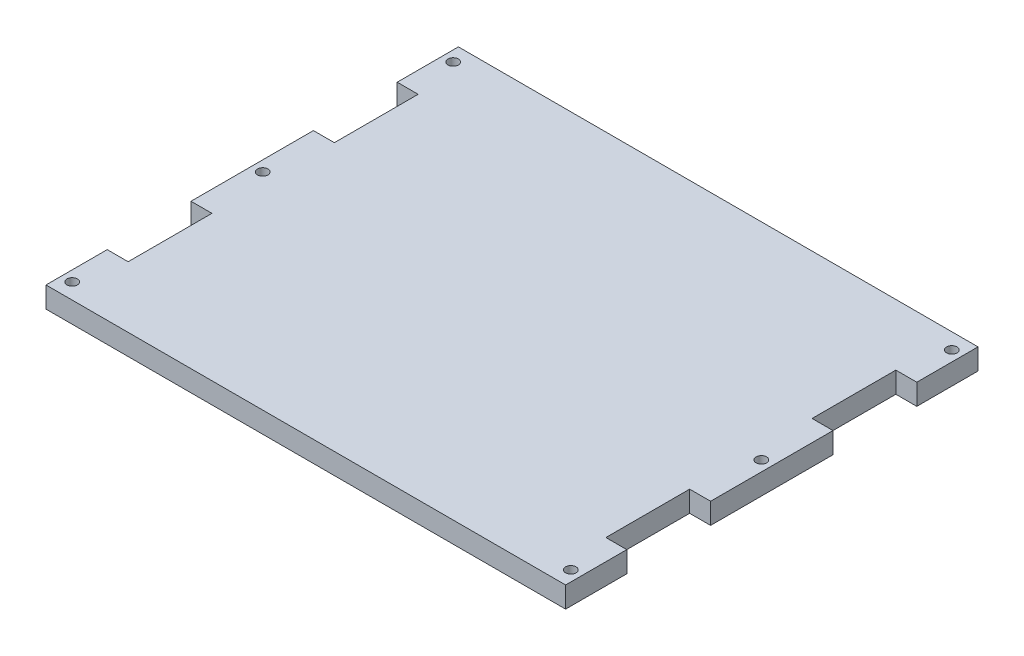
ISO-10303-21;
HEADER;
FILE_DESCRIPTION(('STEP AP214'),'2;1');
FILE_NAME('part.step','',(''),(''),'','','');
FILE_SCHEMA(('AUTOMOTIVE_DESIGN { 1 0 10303 214 1 1 1 1 }'));
ENDSEC;
DATA;
#1=APPLICATION_CONTEXT('core data for automotive mechanical design processes');
#2=APPLICATION_PROTOCOL_DEFINITION('international standard','automotive_design',2000,#1);
#3=PRODUCT_CONTEXT('',#1,'mechanical');
#4=PRODUCT('Part','Part','',(#3));
#5=PRODUCT_RELATED_PRODUCT_CATEGORY('part','',(#4));
#6=PRODUCT_DEFINITION_FORMATION('','',#4);
#7=PRODUCT_DEFINITION_CONTEXT('part definition',#1,'design');
#8=PRODUCT_DEFINITION('design','',#6,#7);
#9=PRODUCT_DEFINITION_SHAPE('','',#8);
#10=(LENGTH_UNIT() NAMED_UNIT(*) SI_UNIT(.MILLI.,.METRE.));
#11=(NAMED_UNIT(*) PLANE_ANGLE_UNIT() SI_UNIT($,.RADIAN.));
#12=(NAMED_UNIT(*) SI_UNIT($,.STERADIAN.) SOLID_ANGLE_UNIT());
#13=UNCERTAINTY_MEASURE_WITH_UNIT(LENGTH_MEASURE(1.E-05),#10,'distance_accuracy_value','');
#14=(GEOMETRIC_REPRESENTATION_CONTEXT(3) GLOBAL_UNCERTAINTY_ASSIGNED_CONTEXT((#13)) GLOBAL_UNIT_ASSIGNED_CONTEXT((#10,
#11,#12)) REPRESENTATION_CONTEXT('',''));
#15=CARTESIAN_POINT('',(0.,0.,0.));
#16=DIRECTION('',(0.,0.,1.));
#17=DIRECTION('',(1.,0.,0.));
#18=AXIS2_PLACEMENT_3D('',#15,#16,#17);
#19=CARTESIAN_POINT('',(0.,12.7,0.));
#20=DIRECTION('',(0.,-1.,0.));
#21=DIRECTION('',(0.,0.,-1.));
#22=AXIS2_PLACEMENT_3D('',#19,#20,#21);
#23=PLANE('',#22);
#24=CARTESIAN_POINT('',(-151.15,12.7,115.475));
#25=DIRECTION('',(0.,1.,0.));
#26=DIRECTION('',(0.,0.,1.));
#27=AXIS2_PLACEMENT_3D('',#24,#25,#26);
#28=CIRCLE('',#27,3.175);
#29=CARTESIAN_POINT('',(-151.15,12.7,118.65));
#30=VERTEX_POINT('',#29);
#31=EDGE_CURVE('E315',#30,#30,#28,.T.);
#32=ORIENTED_EDGE('',*,*,#31,.F.);
#33=EDGE_LOOP('',(#32));
#34=FACE_BOUND('',#33,.T.);
#35=CARTESIAN_POINT('',(-151.15,12.7,0.));
#36=DIRECTION('',(0.,1.,0.));
#37=DIRECTION('',(0.,0.,1.));
#38=AXIS2_PLACEMENT_3D('',#35,#36,#37);
#39=CIRCLE('',#38,3.175);
#40=CARTESIAN_POINT('',(-151.15,12.7,3.17500000000005));
#41=VERTEX_POINT('',#40);
#42=EDGE_CURVE('E309',#41,#41,#39,.T.);
#43=ORIENTED_EDGE('',*,*,#42,.F.);
#44=EDGE_LOOP('',(#43));
#45=FACE_BOUND('',#44,.T.);
#46=CARTESIAN_POINT('',(-151.15,12.7,-115.475));
#47=DIRECTION('',(0.,1.,0.));
#48=DIRECTION('',(0.,0.,1.));
#49=AXIS2_PLACEMENT_3D('',#46,#47,#48);
#50=CIRCLE('',#49,3.17499999999997);
#51=CARTESIAN_POINT('',(-151.15,12.7,-112.3));
#52=VERTEX_POINT('',#51);
#53=EDGE_CURVE('E303',#52,#52,#50,.T.);
#54=ORIENTED_EDGE('',*,*,#53,.F.);
#55=EDGE_LOOP('',(#54));
#56=FACE_BOUND('',#55,.T.);
#57=CARTESIAN_POINT('',(151.15,12.7,-115.475));
#58=DIRECTION('',(0.,1.,0.));
#59=DIRECTION('',(0.,0.,-1.));
#60=AXIS2_PLACEMENT_3D('',#57,#58,#59);
#61=CIRCLE('',#60,3.17499999999997);
#62=CARTESIAN_POINT('',(151.15,12.7,-118.65));
#63=VERTEX_POINT('',#62);
#64=EDGE_CURVE('E297',#63,#63,#61,.T.);
#65=ORIENTED_EDGE('',*,*,#64,.F.);
#66=EDGE_LOOP('',(#65));
#67=FACE_BOUND('',#66,.T.);
#68=CARTESIAN_POINT('',(151.15,12.7,0.));
#69=DIRECTION('',(0.,1.,0.));
#70=DIRECTION('',(0.,0.,-1.));
#71=AXIS2_PLACEMENT_3D('',#68,#69,#70);
#72=CIRCLE('',#71,3.175);
#73=CARTESIAN_POINT('',(151.15,12.7,-3.17499999999998));
#74=VERTEX_POINT('',#73);
#75=EDGE_CURVE('E291',#74,#74,#72,.T.);
#76=ORIENTED_EDGE('',*,*,#75,.F.);
#77=EDGE_LOOP('',(#76));
#78=FACE_BOUND('',#77,.T.);
#79=CARTESIAN_POINT('',(151.15,12.7,115.475));
#80=DIRECTION('',(0.,1.,0.));
#81=DIRECTION('',(0.,0.,-1.));
#82=AXIS2_PLACEMENT_3D('',#79,#80,#81);
#83=CIRCLE('',#82,3.175);
#84=CARTESIAN_POINT('',(151.15,12.7,112.3));
#85=VERTEX_POINT('',#84);
#86=EDGE_CURVE('E285',#85,#85,#83,.T.);
#87=ORIENTED_EDGE('',*,*,#86,.F.);
#88=EDGE_LOOP('',(#87));
#89=FACE_BOUND('',#88,.T.);
#90=DIRECTION('',(-1.,0.,0.));
#91=VECTOR('',#90,1.);
#92=CARTESIAN_POINT('',(157.5,12.7,-37.1));
#93=LINE('',#92,#91);
#94=CARTESIAN_POINT('',(157.5,12.7,-37.1));
#95=VERTEX_POINT('',#94);
#96=CARTESIAN_POINT('',(144.8,12.7,-37.1));
#97=VERTEX_POINT('',#96);
#98=EDGE_CURVE('E191',#95,#97,#93,.T.);
#99=ORIENTED_EDGE('',*,*,#98,.T.);
#100=DIRECTION('',(0.,0.,-1.));
#101=VECTOR('',#100,1.);
#102=CARTESIAN_POINT('',(144.8,12.7,-87.9));
#103=LINE('',#102,#101);
#104=CARTESIAN_POINT('',(144.8,12.7,-87.9));
#105=VERTEX_POINT('',#104);
#106=EDGE_CURVE('E194',#97,#105,#103,.T.);
#107=ORIENTED_EDGE('',*,*,#106,.T.);
#108=DIRECTION('',(1.,0.,0.));
#109=VECTOR('',#108,1.);
#110=CARTESIAN_POINT('',(157.5,12.7,-87.9));
#111=LINE('',#110,#109);
#112=CARTESIAN_POINT('',(157.5,12.7,-87.9));
#113=VERTEX_POINT('',#112);
#114=EDGE_CURVE('E183',#105,#113,#111,.T.);
#115=ORIENTED_EDGE('',*,*,#114,.T.);
#116=DIRECTION('',(0.,0.,-1.));
#117=VECTOR('',#116,1.);
#118=CARTESIAN_POINT('',(157.5,12.7,125.));
#119=LINE('',#118,#117);
#120=CARTESIAN_POINT('',(157.5,12.7,-125.));
#121=VERTEX_POINT('',#120);
#122=EDGE_CURVE('E325',#113,#121,#119,.T.);
#123=ORIENTED_EDGE('',*,*,#122,.T.);
#124=DIRECTION('',(-1.,0.,0.));
#125=VECTOR('',#124,1.);
#126=CARTESIAN_POINT('',(-157.5,12.7,-125.));
#127=LINE('',#126,#125);
#128=CARTESIAN_POINT('',(-157.5,12.7,-125.));
#129=VERTEX_POINT('',#128);
#130=EDGE_CURVE('E323',#121,#129,#127,.T.);
#131=ORIENTED_EDGE('',*,*,#130,.T.);
#132=DIRECTION('',(0.,0.,1.));
#133=VECTOR('',#132,1.);
#134=CARTESIAN_POINT('',(-157.5,12.7,125.));
#135=LINE('',#134,#133);
#136=CARTESIAN_POINT('',(-157.5,12.7,-87.9));
#137=VERTEX_POINT('',#136);
#138=EDGE_CURVE('E328',#129,#137,#135,.T.);
#139=ORIENTED_EDGE('',*,*,#138,.T.);
#140=DIRECTION('',(-1.,0.,0.));
#141=VECTOR('',#140,1.);
#142=CARTESIAN_POINT('',(-157.5,12.7,-87.9));
#143=LINE('',#142,#141);
#144=CARTESIAN_POINT('',(-144.8,12.7,-87.9));
#145=VERTEX_POINT('',#144);
#146=EDGE_CURVE('E237',#145,#137,#143,.T.);
#147=ORIENTED_EDGE('',*,*,#146,.F.);
#148=DIRECTION('',(0.,0.,-1.));
#149=VECTOR('',#148,1.);
#150=CARTESIAN_POINT('',(-144.8,12.7,-87.9));
#151=LINE('',#150,#149);
#152=CARTESIAN_POINT('',(-144.8,12.7,-37.1));
#153=VERTEX_POINT('',#152);
#154=EDGE_CURVE('E247',#153,#145,#151,.T.);
#155=ORIENTED_EDGE('',*,*,#154,.F.);
#156=DIRECTION('',(1.,0.,0.));
#157=VECTOR('',#156,1.);
#158=CARTESIAN_POINT('',(-157.5,12.7,-37.1));
#159=LINE('',#158,#157);
#160=CARTESIAN_POINT('',(-157.5,12.7,-37.1));
#161=VERTEX_POINT('',#160);
#162=EDGE_CURVE('E244',#161,#153,#159,.T.);
#163=ORIENTED_EDGE('',*,*,#162,.F.);
#164=CARTESIAN_POINT('',(-157.5,12.7,37.1));
#165=VERTEX_POINT('',#164);
#166=EDGE_CURVE('E332',#161,#165,#135,.T.);
#167=ORIENTED_EDGE('',*,*,#166,.T.);
#168=DIRECTION('',(-1.,0.,0.));
#169=VECTOR('',#168,1.);
#170=CARTESIAN_POINT('',(-157.5,12.7,37.1));
#171=LINE('',#170,#169);
#172=CARTESIAN_POINT('',(-144.8,12.7,37.1));
#173=VERTEX_POINT('',#172);
#174=EDGE_CURVE('E265',#173,#165,#171,.T.);
#175=ORIENTED_EDGE('',*,*,#174,.F.);
#176=DIRECTION('',(0.,0.,-1.));
#177=VECTOR('',#176,1.);
#178=CARTESIAN_POINT('',(-144.8,12.7,87.9));
#179=LINE('',#178,#177);
#180=CARTESIAN_POINT('',(-144.8,12.7,87.9));
#181=VERTEX_POINT('',#180);
#182=EDGE_CURVE('E274',#181,#173,#179,.T.);
#183=ORIENTED_EDGE('',*,*,#182,.F.);
#184=DIRECTION('',(1.,0.,0.));
#185=VECTOR('',#184,1.);
#186=CARTESIAN_POINT('',(-157.5,12.7,87.9));
#187=LINE('',#186,#185);
#188=CARTESIAN_POINT('',(-157.5,12.7,87.9));
#189=VERTEX_POINT('',#188);
#190=EDGE_CURVE('E207',#189,#181,#187,.T.);
#191=ORIENTED_EDGE('',*,*,#190,.F.);
#192=CARTESIAN_POINT('',(-157.5,12.7,125.));
#193=VERTEX_POINT('',#192);
#194=EDGE_CURVE('E327',#189,#193,#135,.T.);
#195=ORIENTED_EDGE('',*,*,#194,.T.);
#196=DIRECTION('',(1.,0.,0.));
#197=VECTOR('',#196,1.);
#198=CARTESIAN_POINT('',(-157.5,12.7,125.));
#199=LINE('',#198,#197);
#200=CARTESIAN_POINT('',(157.5,12.7,125.));
#201=VERTEX_POINT('',#200);
#202=EDGE_CURVE('E331',#193,#201,#199,.T.);
#203=ORIENTED_EDGE('',*,*,#202,.T.);
#204=CARTESIAN_POINT('',(157.5,12.7,87.9));
#205=VERTEX_POINT('',#204);
#206=EDGE_CURVE('E320',#201,#205,#119,.T.);
#207=ORIENTED_EDGE('',*,*,#206,.T.);
#208=DIRECTION('',(-1.,0.,0.));
#209=VECTOR('',#208,1.);
#210=CARTESIAN_POINT('',(157.5,12.7,87.9));
#211=LINE('',#210,#209);
#212=CARTESIAN_POINT('',(144.8,12.7,87.9));
#213=VERTEX_POINT('',#212);
#214=EDGE_CURVE('E212',#205,#213,#211,.T.);
#215=ORIENTED_EDGE('',*,*,#214,.T.);
#216=DIRECTION('',(0.,0.,-1.));
#217=VECTOR('',#216,1.);
#218=CARTESIAN_POINT('',(144.8,12.7,87.9));
#219=LINE('',#218,#217);
#220=CARTESIAN_POINT('',(144.8,12.7,37.1));
#221=VERTEX_POINT('',#220);
#222=EDGE_CURVE('E220',#213,#221,#219,.T.);
#223=ORIENTED_EDGE('',*,*,#222,.T.);
#224=DIRECTION('',(1.,0.,0.));
#225=VECTOR('',#224,1.);
#226=CARTESIAN_POINT('',(157.5,12.7,37.1));
#227=LINE('',#226,#225);
#228=CARTESIAN_POINT('',(157.5,12.7,37.1));
#229=VERTEX_POINT('',#228);
#230=EDGE_CURVE('E217',#221,#229,#227,.T.);
#231=ORIENTED_EDGE('',*,*,#230,.T.);
#232=EDGE_CURVE('E324',#229,#95,#119,.T.);
#233=ORIENTED_EDGE('',*,*,#232,.T.);
#234=EDGE_LOOP('',(#99,#107,#115,#123,#131,#139,#147,#155,#163,#167,#175,#183,#191,#195,#203,
#207,#215,#223,#231,#233));
#235=FACE_BOUND('',#234,.T.);
#236=ADVANCED_FACE('F32',(#34,#45,#56,#67,#78,#89,#235),#23,.F.);
#237=CARTESIAN_POINT('',(0.,0.,0.));
#238=DIRECTION('',(0.,-1.,0.));
#239=DIRECTION('',(0.,0.,-1.));
#240=AXIS2_PLACEMENT_3D('',#237,#238,#239);
#241=PLANE('',#240);
#242=CARTESIAN_POINT('',(-104.5,0.,63.0000000000001));
#243=DIRECTION('',(0.,-1.,0.));
#244=DIRECTION('',(0.,0.,-1.));
#245=AXIS2_PLACEMENT_3D('',#242,#243,#244);
#246=CIRCLE('',#245,5.00000000000001);
#247=CARTESIAN_POINT('',(-104.5,0.,58.0000000000001));
#248=VERTEX_POINT('',#247);
#249=EDGE_CURVE('E197',#248,#248,#246,.T.);
#250=ORIENTED_EDGE('',*,*,#249,.F.);
#251=EDGE_LOOP('',(#250));
#252=FACE_BOUND('',#251,.T.);
#253=CARTESIAN_POINT('',(151.15,0.,0.));
#254=DIRECTION('',(0.,1.,0.));
#255=DIRECTION('',(0.,0.,-1.));
#256=AXIS2_PLACEMENT_3D('',#253,#254,#255);
#257=CIRCLE('',#256,3.175);
#258=CARTESIAN_POINT('',(151.15,0.,-3.17499999999998));
#259=VERTEX_POINT('',#258);
#260=EDGE_CURVE('E288',#259,#259,#257,.T.);
#261=ORIENTED_EDGE('',*,*,#260,.T.);
#262=EDGE_LOOP('',(#261));
#263=FACE_BOUND('',#262,.T.);
#264=CARTESIAN_POINT('',(-151.15,0.,-115.475));
#265=DIRECTION('',(0.,1.,0.));
#266=DIRECTION('',(0.,0.,1.));
#267=AXIS2_PLACEMENT_3D('',#264,#265,#266);
#268=CIRCLE('',#267,3.17499999999997);
#269=CARTESIAN_POINT('',(-151.15,0.,-112.3));
#270=VERTEX_POINT('',#269);
#271=EDGE_CURVE('E300',#270,#270,#268,.T.);
#272=ORIENTED_EDGE('',*,*,#271,.T.);
#273=EDGE_LOOP('',(#272));
#274=FACE_BOUND('',#273,.T.);
#275=CARTESIAN_POINT('',(-151.15,0.,115.475));
#276=DIRECTION('',(0.,1.,0.));
#277=DIRECTION('',(0.,0.,1.));
#278=AXIS2_PLACEMENT_3D('',#275,#276,#277);
#279=CIRCLE('',#278,3.175);
#280=CARTESIAN_POINT('',(-151.15,0.,118.65));
#281=VERTEX_POINT('',#280);
#282=EDGE_CURVE('E312',#281,#281,#279,.T.);
#283=ORIENTED_EDGE('',*,*,#282,.T.);
#284=EDGE_LOOP('',(#283));
#285=FACE_BOUND('',#284,.T.);
#286=CARTESIAN_POINT('',(-151.15,0.,0.));
#287=DIRECTION('',(0.,1.,0.));
#288=DIRECTION('',(0.,0.,1.));
#289=AXIS2_PLACEMENT_3D('',#286,#287,#288);
#290=CIRCLE('',#289,3.175);
#291=CARTESIAN_POINT('',(-151.15,0.,3.17500000000005));
#292=VERTEX_POINT('',#291);
#293=EDGE_CURVE('E306',#292,#292,#290,.T.);
#294=ORIENTED_EDGE('',*,*,#293,.T.);
#295=EDGE_LOOP('',(#294));
#296=FACE_BOUND('',#295,.T.);
#297=CARTESIAN_POINT('',(151.15,0.,-115.475));
#298=DIRECTION('',(0.,1.,0.));
#299=DIRECTION('',(0.,0.,-1.));
#300=AXIS2_PLACEMENT_3D('',#297,#298,#299);
#301=CIRCLE('',#300,3.17499999999997);
#302=CARTESIAN_POINT('',(151.15,0.,-118.65));
#303=VERTEX_POINT('',#302);
#304=EDGE_CURVE('E294',#303,#303,#301,.T.);
#305=ORIENTED_EDGE('',*,*,#304,.T.);
#306=EDGE_LOOP('',(#305));
#307=FACE_BOUND('',#306,.T.);
#308=CARTESIAN_POINT('',(151.15,0.,115.475));
#309=DIRECTION('',(0.,1.,0.));
#310=DIRECTION('',(0.,0.,-1.));
#311=AXIS2_PLACEMENT_3D('',#308,#309,#310);
#312=CIRCLE('',#311,3.175);
#313=CARTESIAN_POINT('',(151.15,0.,112.3));
#314=VERTEX_POINT('',#313);
#315=EDGE_CURVE('E255',#314,#314,#312,.T.);
#316=ORIENTED_EDGE('',*,*,#315,.T.);
#317=EDGE_LOOP('',(#316));
#318=FACE_BOUND('',#317,.T.);
#319=DIRECTION('',(0.,0.,-1.));
#320=VECTOR('',#319,1.);
#321=CARTESIAN_POINT('',(144.8,0.,-87.9));
#322=LINE('',#321,#320);
#323=CARTESIAN_POINT('',(144.8,0.,-37.1));
#324=VERTEX_POINT('',#323);
#325=CARTESIAN_POINT('',(144.8,0.,-87.9));
#326=VERTEX_POINT('',#325);
#327=EDGE_CURVE('E171',#324,#326,#322,.T.);
#328=ORIENTED_EDGE('',*,*,#327,.F.);
#329=DIRECTION('',(-1.,0.,0.));
#330=VECTOR('',#329,1.);
#331=CARTESIAN_POINT('',(157.5,0.,-37.1));
#332=LINE('',#331,#330);
#333=CARTESIAN_POINT('',(157.5,0.,-37.1));
#334=VERTEX_POINT('',#333);
#335=EDGE_CURVE('E179',#334,#324,#332,.T.);
#336=ORIENTED_EDGE('',*,*,#335,.F.);
#337=DIRECTION('',(0.,0.,-1.));
#338=VECTOR('',#337,1.);
#339=CARTESIAN_POINT('',(157.5,0.,125.));
#340=LINE('',#339,#338);
#341=CARTESIAN_POINT('',(157.5,0.,37.1));
#342=VERTEX_POINT('',#341);
#343=EDGE_CURVE('E339',#342,#334,#340,.T.);
#344=ORIENTED_EDGE('',*,*,#343,.F.);
#345=DIRECTION('',(1.,0.,0.));
#346=VECTOR('',#345,1.);
#347=CARTESIAN_POINT('',(157.5,0.,37.1));
#348=LINE('',#347,#346);
#349=CARTESIAN_POINT('',(144.8,0.,37.1));
#350=VERTEX_POINT('',#349);
#351=EDGE_CURVE('E55',#350,#342,#348,.T.);
#352=ORIENTED_EDGE('',*,*,#351,.F.);
#353=DIRECTION('',(0.,0.,-1.));
#354=VECTOR('',#353,1.);
#355=CARTESIAN_POINT('',(144.8,0.,87.9));
#356=LINE('',#355,#354);
#357=CARTESIAN_POINT('',(144.8,0.,87.9));
#358=VERTEX_POINT('',#357);
#359=EDGE_CURVE('E211',#358,#350,#356,.T.);
#360=ORIENTED_EDGE('',*,*,#359,.F.);
#361=DIRECTION('',(-1.,0.,0.));
#362=VECTOR('',#361,1.);
#363=CARTESIAN_POINT('',(157.5,0.,87.9));
#364=LINE('',#363,#362);
#365=CARTESIAN_POINT('',(157.5,0.,87.9));
#366=VERTEX_POINT('',#365);
#367=EDGE_CURVE('E214',#366,#358,#364,.T.);
#368=ORIENTED_EDGE('',*,*,#367,.F.);
#369=CARTESIAN_POINT('',(157.5,0.,125.));
#370=VERTEX_POINT('',#369);
#371=EDGE_CURVE('E335',#370,#366,#340,.T.);
#372=ORIENTED_EDGE('',*,*,#371,.F.);
#373=DIRECTION('',(1.,0.,0.));
#374=VECTOR('',#373,1.);
#375=CARTESIAN_POINT('',(-157.5,0.,125.));
#376=LINE('',#375,#374);
#377=CARTESIAN_POINT('',(-157.5,0.,125.));
#378=VERTEX_POINT('',#377);
#379=EDGE_CURVE('E345',#378,#370,#376,.T.);
#380=ORIENTED_EDGE('',*,*,#379,.F.);
#381=DIRECTION('',(0.,0.,1.));
#382=VECTOR('',#381,1.);
#383=CARTESIAN_POINT('',(-157.5,0.,125.));
#384=LINE('',#383,#382);
#385=CARTESIAN_POINT('',(-157.5,0.,87.9));
#386=VERTEX_POINT('',#385);
#387=EDGE_CURVE('E341',#386,#378,#384,.T.);
#388=ORIENTED_EDGE('',*,*,#387,.F.);
#389=DIRECTION('',(1.,0.,0.));
#390=VECTOR('',#389,1.);
#391=CARTESIAN_POINT('',(-157.5,0.,87.9));
#392=LINE('',#391,#390);
#393=CARTESIAN_POINT('',(-144.8,0.,87.9));
#394=VERTEX_POINT('',#393);
#395=EDGE_CURVE('E261',#386,#394,#392,.T.);
#396=ORIENTED_EDGE('',*,*,#395,.T.);
#397=DIRECTION('',(0.,0.,-1.));
#398=VECTOR('',#397,1.);
#399=CARTESIAN_POINT('',(-144.8,0.,87.9));
#400=LINE('',#399,#398);
#401=CARTESIAN_POINT('',(-144.8,0.,37.1));
#402=VERTEX_POINT('',#401);
#403=EDGE_CURVE('E264',#394,#402,#400,.T.);
#404=ORIENTED_EDGE('',*,*,#403,.T.);
#405=DIRECTION('',(-1.,0.,0.));
#406=VECTOR('',#405,1.);
#407=CARTESIAN_POINT('',(-157.5,0.,37.1));
#408=LINE('',#407,#406);
#409=CARTESIAN_POINT('',(-157.5,0.,37.1));
#410=VERTEX_POINT('',#409);
#411=EDGE_CURVE('E268',#402,#410,#408,.T.);
#412=ORIENTED_EDGE('',*,*,#411,.T.);
#413=CARTESIAN_POINT('',(-157.5,0.,-37.1));
#414=VERTEX_POINT('',#413);
#415=EDGE_CURVE('E346',#414,#410,#384,.T.);
#416=ORIENTED_EDGE('',*,*,#415,.F.);
#417=DIRECTION('',(1.,0.,0.));
#418=VECTOR('',#417,1.);
#419=CARTESIAN_POINT('',(-157.5,0.,-37.1));
#420=LINE('',#419,#418);
#421=CARTESIAN_POINT('',(-144.8,0.,-37.1));
#422=VERTEX_POINT('',#421);
#423=EDGE_CURVE('E233',#414,#422,#420,.T.);
#424=ORIENTED_EDGE('',*,*,#423,.T.);
#425=DIRECTION('',(0.,0.,-1.));
#426=VECTOR('',#425,1.);
#427=CARTESIAN_POINT('',(-144.8,0.,-87.9));
#428=LINE('',#427,#426);
#429=CARTESIAN_POINT('',(-144.8,0.,-87.9));
#430=VERTEX_POINT('',#429);
#431=EDGE_CURVE('E236',#422,#430,#428,.T.);
#432=ORIENTED_EDGE('',*,*,#431,.T.);
#433=DIRECTION('',(-1.,0.,0.));
#434=VECTOR('',#433,1.);
#435=CARTESIAN_POINT('',(-157.5,0.,-87.9));
#436=LINE('',#435,#434);
#437=CARTESIAN_POINT('',(-157.5,0.,-87.9));
#438=VERTEX_POINT('',#437);
#439=EDGE_CURVE('E240',#430,#438,#436,.T.);
#440=ORIENTED_EDGE('',*,*,#439,.T.);
#441=CARTESIAN_POINT('',(-157.5,0.,-125.));
#442=VERTEX_POINT('',#441);
#443=EDGE_CURVE('E342',#442,#438,#384,.T.);
#444=ORIENTED_EDGE('',*,*,#443,.F.);
#445=DIRECTION('',(-1.,0.,0.));
#446=VECTOR('',#445,1.);
#447=CARTESIAN_POINT('',(-157.5,0.,-125.));
#448=LINE('',#447,#446);
#449=CARTESIAN_POINT('',(157.5,0.,-125.));
#450=VERTEX_POINT('',#449);
#451=EDGE_CURVE('E338',#450,#442,#448,.T.);
#452=ORIENTED_EDGE('',*,*,#451,.F.);
#453=CARTESIAN_POINT('',(157.5,0.,-87.9));
#454=VERTEX_POINT('',#453);
#455=EDGE_CURVE('E190',#454,#450,#340,.T.);
#456=ORIENTED_EDGE('',*,*,#455,.F.);
#457=DIRECTION('',(1.,0.,0.));
#458=VECTOR('',#457,1.);
#459=CARTESIAN_POINT('',(157.5,0.,-87.9));
#460=LINE('',#459,#458);
#461=EDGE_CURVE('E47',#326,#454,#460,.T.);
#462=ORIENTED_EDGE('',*,*,#461,.F.);
#463=EDGE_LOOP('',(#328,#336,#344,#352,#360,#368,#372,#380,#388,#396,#404,#412,#416,#424,#432,
#440,#444,#452,#456,#462));
#464=FACE_BOUND('',#463,.T.);
#465=ADVANCED_FACE('F188',(#252,#263,#274,#285,#296,#307,#318,#464),#241,.T.);
#466=CARTESIAN_POINT('',(157.5,12.7,125.));
#467=DIRECTION('',(-1.,0.,0.));
#468=DIRECTION('',(0.,0.,1.));
#469=AXIS2_PLACEMENT_3D('',#466,#467,#468);
#470=PLANE('',#469);
#471=DIRECTION('',(0.,1.,0.));
#472=VECTOR('',#471,1.);
#473=CARTESIAN_POINT('',(157.5,0.,-37.1));
#474=LINE('',#473,#472);
#475=EDGE_CURVE('E204',#334,#95,#474,.T.);
#476=ORIENTED_EDGE('',*,*,#475,.T.);
#477=ORIENTED_EDGE('',*,*,#232,.F.);
#478=DIRECTION('',(0.,1.,0.));
#479=VECTOR('',#478,1.);
#480=CARTESIAN_POINT('',(157.5,0.,37.1));
#481=LINE('',#480,#479);
#482=EDGE_CURVE('E216',#342,#229,#481,.T.);
#483=ORIENTED_EDGE('',*,*,#482,.F.);
#484=ORIENTED_EDGE('',*,*,#343,.T.);
#485=EDGE_LOOP('',(#476,#477,#483,#484));
#486=FACE_BOUND('',#485,.T.);
#487=ADVANCED_FACE('F34',(#486),#470,.F.);
#488=DIRECTION('',(0.,1.,0.));
#489=VECTOR('',#488,1.);
#490=CARTESIAN_POINT('',(157.5,0.,-87.9));
#491=LINE('',#490,#489);
#492=EDGE_CURVE('E185',#454,#113,#491,.T.);
#493=ORIENTED_EDGE('',*,*,#492,.F.);
#494=ORIENTED_EDGE('',*,*,#455,.T.);
#495=DIRECTION('',(0.,-1.,0.));
#496=VECTOR('',#495,1.);
#497=CARTESIAN_POINT('',(157.5,12.7,-125.));
#498=LINE('',#497,#496);
#499=EDGE_CURVE('E11',#121,#450,#498,.T.);
#500=ORIENTED_EDGE('',*,*,#499,.F.);
#501=ORIENTED_EDGE('',*,*,#122,.F.);
#502=EDGE_LOOP('',(#493,#494,#500,#501));
#503=FACE_BOUND('',#502,.T.);
#504=ADVANCED_FACE('F371',(#503),#470,.F.);
#505=DIRECTION('',(0.,1.,0.));
#506=VECTOR('',#505,1.);
#507=CARTESIAN_POINT('',(157.5,0.,87.9));
#508=LINE('',#507,#506);
#509=EDGE_CURVE('E202',#366,#205,#508,.T.);
#510=ORIENTED_EDGE('',*,*,#509,.T.);
#511=ORIENTED_EDGE('',*,*,#206,.F.);
#512=DIRECTION('',(0.,-1.,0.));
#513=VECTOR('',#512,1.);
#514=CARTESIAN_POINT('',(157.5,12.7,125.));
#515=LINE('',#514,#513);
#516=EDGE_CURVE('E334',#201,#370,#515,.T.);
#517=ORIENTED_EDGE('',*,*,#516,.T.);
#518=ORIENTED_EDGE('',*,*,#371,.T.);
#519=EDGE_LOOP('',(#510,#511,#517,#518));
#520=FACE_BOUND('',#519,.T.);
#521=ADVANCED_FACE('F391',(#520),#470,.F.);
#522=CARTESIAN_POINT('',(-157.5,12.7,125.));
#523=DIRECTION('',(1.,0.,0.));
#524=DIRECTION('',(0.,0.,-1.));
#525=AXIS2_PLACEMENT_3D('',#522,#523,#524);
#526=PLANE('',#525);
#527=ORIENTED_EDGE('',*,*,#443,.T.);
#528=DIRECTION('',(0.,1.,0.));
#529=VECTOR('',#528,1.);
#530=CARTESIAN_POINT('',(-157.5,0.,-87.9));
#531=LINE('',#530,#529);
#532=EDGE_CURVE('E252',#438,#137,#531,.T.);
#533=ORIENTED_EDGE('',*,*,#532,.T.);
#534=ORIENTED_EDGE('',*,*,#138,.F.);
#535=DIRECTION('',(0.,-1.,0.));
#536=VECTOR('',#535,1.);
#537=CARTESIAN_POINT('',(-157.5,12.7,-125.));
#538=LINE('',#537,#536);
#539=EDGE_CURVE('E40',#129,#442,#538,.T.);
#540=ORIENTED_EDGE('',*,*,#539,.T.);
#541=EDGE_LOOP('',(#527,#533,#534,#540));
#542=FACE_BOUND('',#541,.T.);
#543=ADVANCED_FACE('F357',(#542),#526,.F.);
#544=ORIENTED_EDGE('',*,*,#166,.F.);
#545=DIRECTION('',(0.,1.,0.));
#546=VECTOR('',#545,1.);
#547=CARTESIAN_POINT('',(-157.5,0.,-37.1));
#548=LINE('',#547,#546);
#549=EDGE_CURVE('E243',#414,#161,#548,.T.);
#550=ORIENTED_EDGE('',*,*,#549,.F.);
#551=ORIENTED_EDGE('',*,*,#415,.T.);
#552=DIRECTION('',(0.,1.,0.));
#553=VECTOR('',#552,1.);
#554=CARTESIAN_POINT('',(-157.5,0.,37.1));
#555=LINE('',#554,#553);
#556=EDGE_CURVE('E248',#410,#165,#555,.T.);
#557=ORIENTED_EDGE('',*,*,#556,.T.);
#558=EDGE_LOOP('',(#544,#550,#551,#557));
#559=FACE_BOUND('',#558,.T.);
#560=ADVANCED_FACE('F406',(#559),#526,.F.);
#561=CARTESIAN_POINT('',(-157.5,12.7,-125.));
#562=DIRECTION('',(0.,0.,1.));
#563=DIRECTION('',(1.,0.,0.));
#564=AXIS2_PLACEMENT_3D('',#561,#562,#563);
#565=PLANE('',#564);
#566=ORIENTED_EDGE('',*,*,#451,.T.);
#567=ORIENTED_EDGE('',*,*,#539,.F.);
#568=ORIENTED_EDGE('',*,*,#130,.F.);
#569=ORIENTED_EDGE('',*,*,#499,.T.);
#570=EDGE_LOOP('',(#566,#567,#568,#569));
#571=FACE_BOUND('',#570,.T.);
#572=ADVANCED_FACE('F369',(#571),#565,.F.);
#573=ORIENTED_EDGE('',*,*,#194,.F.);
#574=DIRECTION('',(0.,1.,0.));
#575=VECTOR('',#574,1.);
#576=CARTESIAN_POINT('',(-157.5,0.,87.9));
#577=LINE('',#576,#575);
#578=EDGE_CURVE('E271',#386,#189,#577,.T.);
#579=ORIENTED_EDGE('',*,*,#578,.F.);
#580=ORIENTED_EDGE('',*,*,#387,.T.);
#581=DIRECTION('',(0.,-1.,0.));
#582=VECTOR('',#581,1.);
#583=CARTESIAN_POINT('',(-157.5,12.7,125.));
#584=LINE('',#583,#582);
#585=EDGE_CURVE('E350',#193,#378,#584,.T.);
#586=ORIENTED_EDGE('',*,*,#585,.F.);
#587=EDGE_LOOP('',(#573,#579,#580,#586));
#588=FACE_BOUND('',#587,.T.);
#589=ADVANCED_FACE('F417',(#588),#526,.F.);
#590=CARTESIAN_POINT('',(-157.5,12.7,125.));
#591=DIRECTION('',(0.,0.,-1.));
#592=DIRECTION('',(-1.,0.,0.));
#593=AXIS2_PLACEMENT_3D('',#590,#591,#592);
#594=PLANE('',#593);
#595=ORIENTED_EDGE('',*,*,#379,.T.);
#596=ORIENTED_EDGE('',*,*,#516,.F.);
#597=ORIENTED_EDGE('',*,*,#202,.F.);
#598=ORIENTED_EDGE('',*,*,#585,.T.);
#599=EDGE_LOOP('',(#595,#596,#597,#598));
#600=FACE_BOUND('',#599,.T.);
#601=ADVANCED_FACE('F396',(#600),#594,.F.);
#602=CARTESIAN_POINT('',(-151.15,12.7,115.475));
#603=DIRECTION('',(0.,-1.,0.));
#604=DIRECTION('',(0.,0.,-1.));
#605=AXIS2_PLACEMENT_3D('',#602,#603,#604);
#606=CYLINDRICAL_SURFACE('',#605,3.175);
#607=ORIENTED_EDGE('',*,*,#31,.T.);
#608=EDGE_LOOP('',(#607));
#609=FACE_BOUND('',#608,.T.);
#610=ORIENTED_EDGE('',*,*,#282,.F.);
#611=EDGE_LOOP('',(#610));
#612=FACE_BOUND('',#611,.T.);
#613=ADVANCED_FACE('F424',(#609,#612),#606,.F.);
#614=CARTESIAN_POINT('',(-151.15,12.7,0.));
#615=DIRECTION('',(0.,-1.,0.));
#616=DIRECTION('',(0.,0.,-1.));
#617=AXIS2_PLACEMENT_3D('',#614,#615,#616);
#618=CYLINDRICAL_SURFACE('',#617,3.175);
#619=ORIENTED_EDGE('',*,*,#42,.T.);
#620=EDGE_LOOP('',(#619));
#621=FACE_BOUND('',#620,.T.);
#622=ORIENTED_EDGE('',*,*,#293,.F.);
#623=EDGE_LOOP('',(#622));
#624=FACE_BOUND('',#623,.T.);
#625=ADVANCED_FACE('F442',(#621,#624),#618,.F.);
#626=CARTESIAN_POINT('',(-151.15,12.7,-115.475));
#627=DIRECTION('',(0.,-1.,0.));
#628=DIRECTION('',(0.,0.,-1.));
#629=AXIS2_PLACEMENT_3D('',#626,#627,#628);
#630=CYLINDRICAL_SURFACE('',#629,3.17499999999997);
#631=ORIENTED_EDGE('',*,*,#53,.T.);
#632=EDGE_LOOP('',(#631));
#633=FACE_BOUND('',#632,.T.);
#634=ORIENTED_EDGE('',*,*,#271,.F.);
#635=EDGE_LOOP('',(#634));
#636=FACE_BOUND('',#635,.T.);
#637=ADVANCED_FACE('F446',(#633,#636),#630,.F.);
#638=CARTESIAN_POINT('',(151.15,12.7,-115.475));
#639=DIRECTION('',(0.,-1.,0.));
#640=DIRECTION('',(0.,0.,-1.));
#641=AXIS2_PLACEMENT_3D('',#638,#639,#640);
#642=CYLINDRICAL_SURFACE('',#641,3.17499999999997);
#643=ORIENTED_EDGE('',*,*,#64,.T.);
#644=EDGE_LOOP('',(#643));
#645=FACE_BOUND('',#644,.T.);
#646=ORIENTED_EDGE('',*,*,#304,.F.);
#647=EDGE_LOOP('',(#646));
#648=FACE_BOUND('',#647,.T.);
#649=ADVANCED_FACE('F450',(#645,#648),#642,.F.);
#650=CARTESIAN_POINT('',(151.15,12.7,0.));
#651=DIRECTION('',(0.,-1.,0.));
#652=DIRECTION('',(0.,0.,-1.));
#653=AXIS2_PLACEMENT_3D('',#650,#651,#652);
#654=CYLINDRICAL_SURFACE('',#653,3.175);
#655=ORIENTED_EDGE('',*,*,#75,.T.);
#656=EDGE_LOOP('',(#655));
#657=FACE_BOUND('',#656,.T.);
#658=ORIENTED_EDGE('',*,*,#260,.F.);
#659=EDGE_LOOP('',(#658));
#660=FACE_BOUND('',#659,.T.);
#661=ADVANCED_FACE('F454',(#657,#660),#654,.F.);
#662=CARTESIAN_POINT('',(151.15,12.7,115.475));
#663=DIRECTION('',(0.,-1.,0.));
#664=DIRECTION('',(0.,0.,-1.));
#665=AXIS2_PLACEMENT_3D('',#662,#663,#664);
#666=CYLINDRICAL_SURFACE('',#665,3.175);
#667=ORIENTED_EDGE('',*,*,#86,.T.);
#668=EDGE_LOOP('',(#667));
#669=FACE_BOUND('',#668,.T.);
#670=ORIENTED_EDGE('',*,*,#315,.F.);
#671=EDGE_LOOP('',(#670));
#672=FACE_BOUND('',#671,.T.);
#673=ADVANCED_FACE('F458',(#669,#672),#666,.F.);
#674=CARTESIAN_POINT('',(-157.5,0.,37.1));
#675=DIRECTION('',(0.,0.,-1.));
#676=DIRECTION('',(-1.,0.,0.));
#677=AXIS2_PLACEMENT_3D('',#674,#675,#676);
#678=PLANE('',#677);
#679=ORIENTED_EDGE('',*,*,#174,.T.);
#680=ORIENTED_EDGE('',*,*,#556,.F.);
#681=ORIENTED_EDGE('',*,*,#411,.F.);
#682=DIRECTION('',(0.,1.,0.));
#683=VECTOR('',#682,1.);
#684=CARTESIAN_POINT('',(-144.8,0.,37.1));
#685=LINE('',#684,#683);
#686=EDGE_CURVE('E280',#402,#173,#685,.T.);
#687=ORIENTED_EDGE('',*,*,#686,.T.);
#688=EDGE_LOOP('',(#679,#680,#681,#687));
#689=FACE_BOUND('',#688,.T.);
#690=ADVANCED_FACE('F411',(#689),#678,.F.);
#691=CARTESIAN_POINT('',(-144.8,0.,87.9));
#692=DIRECTION('',(1.,0.,0.));
#693=DIRECTION('',(0.,0.,-1.));
#694=AXIS2_PLACEMENT_3D('',#691,#692,#693);
#695=PLANE('',#694);
#696=ORIENTED_EDGE('',*,*,#182,.T.);
#697=ORIENTED_EDGE('',*,*,#686,.F.);
#698=ORIENTED_EDGE('',*,*,#403,.F.);
#699=DIRECTION('',(0.,1.,0.));
#700=VECTOR('',#699,1.);
#701=CARTESIAN_POINT('',(-144.8,0.,87.9));
#702=LINE('',#701,#700);
#703=EDGE_CURVE('E282',#394,#181,#702,.T.);
#704=ORIENTED_EDGE('',*,*,#703,.T.);
#705=EDGE_LOOP('',(#696,#697,#698,#704));
#706=FACE_BOUND('',#705,.T.);
#707=ADVANCED_FACE('F466',(#706),#695,.F.);
#708=CARTESIAN_POINT('',(-157.5,0.,87.9));
#709=DIRECTION('',(0.,0.,1.));
#710=DIRECTION('',(1.,0.,0.));
#711=AXIS2_PLACEMENT_3D('',#708,#709,#710);
#712=PLANE('',#711);
#713=ORIENTED_EDGE('',*,*,#190,.T.);
#714=ORIENTED_EDGE('',*,*,#703,.F.);
#715=ORIENTED_EDGE('',*,*,#395,.F.);
#716=ORIENTED_EDGE('',*,*,#578,.T.);
#717=EDGE_LOOP('',(#713,#714,#715,#716));
#718=FACE_BOUND('',#717,.T.);
#719=ADVANCED_FACE('F463',(#718),#712,.F.);
#720=CARTESIAN_POINT('',(-157.5,0.,-87.9));
#721=DIRECTION('',(0.,0.,-1.));
#722=DIRECTION('',(-1.,0.,0.));
#723=AXIS2_PLACEMENT_3D('',#720,#721,#722);
#724=PLANE('',#723);
#725=ORIENTED_EDGE('',*,*,#146,.T.);
#726=ORIENTED_EDGE('',*,*,#532,.F.);
#727=ORIENTED_EDGE('',*,*,#439,.F.);
#728=DIRECTION('',(0.,1.,0.));
#729=VECTOR('',#728,1.);
#730=CARTESIAN_POINT('',(-144.8,0.,-87.9));
#731=LINE('',#730,#729);
#732=EDGE_CURVE('E256',#430,#145,#731,.T.);
#733=ORIENTED_EDGE('',*,*,#732,.T.);
#734=EDGE_LOOP('',(#725,#726,#727,#733));
#735=FACE_BOUND('',#734,.T.);
#736=ADVANCED_FACE('F363',(#735),#724,.F.);
#737=CARTESIAN_POINT('',(-144.8,0.,-87.9));
#738=DIRECTION('',(1.,0.,0.));
#739=DIRECTION('',(0.,0.,-1.));
#740=AXIS2_PLACEMENT_3D('',#737,#738,#739);
#741=PLANE('',#740);
#742=ORIENTED_EDGE('',*,*,#154,.T.);
#743=ORIENTED_EDGE('',*,*,#732,.F.);
#744=ORIENTED_EDGE('',*,*,#431,.F.);
#745=DIRECTION('',(0.,1.,0.));
#746=VECTOR('',#745,1.);
#747=CARTESIAN_POINT('',(-144.8,0.,-37.1));
#748=LINE('',#747,#746);
#749=EDGE_CURVE('E258',#422,#153,#748,.T.);
#750=ORIENTED_EDGE('',*,*,#749,.T.);
#751=EDGE_LOOP('',(#742,#743,#744,#750));
#752=FACE_BOUND('',#751,.T.);
#753=ADVANCED_FACE('F477',(#752),#741,.F.);
#754=CARTESIAN_POINT('',(-157.5,0.,-37.1));
#755=DIRECTION('',(0.,0.,1.));
#756=DIRECTION('',(1.,0.,0.));
#757=AXIS2_PLACEMENT_3D('',#754,#755,#756);
#758=PLANE('',#757);
#759=ORIENTED_EDGE('',*,*,#162,.T.);
#760=ORIENTED_EDGE('',*,*,#749,.F.);
#761=ORIENTED_EDGE('',*,*,#423,.F.);
#762=ORIENTED_EDGE('',*,*,#549,.T.);
#763=EDGE_LOOP('',(#759,#760,#761,#762));
#764=FACE_BOUND('',#763,.T.);
#765=ADVANCED_FACE('F473',(#764),#758,.F.);
#766=CARTESIAN_POINT('',(157.5,0.,87.9));
#767=DIRECTION('',(0.,0.,-1.));
#768=DIRECTION('',(-1.,0.,0.));
#769=AXIS2_PLACEMENT_3D('',#766,#767,#768);
#770=PLANE('',#769);
#771=ORIENTED_EDGE('',*,*,#214,.F.);
#772=ORIENTED_EDGE('',*,*,#509,.F.);
#773=ORIENTED_EDGE('',*,*,#367,.T.);
#774=DIRECTION('',(0.,1.,0.));
#775=VECTOR('',#774,1.);
#776=CARTESIAN_POINT('',(144.8,0.,87.9));
#777=LINE('',#776,#775);
#778=EDGE_CURVE('E228',#358,#213,#777,.T.);
#779=ORIENTED_EDGE('',*,*,#778,.T.);
#780=EDGE_LOOP('',(#771,#772,#773,#779));
#781=FACE_BOUND('',#780,.T.);
#782=ADVANCED_FACE('F476',(#781),#770,.T.);
#783=CARTESIAN_POINT('',(144.8,0.,87.9));
#784=DIRECTION('',(1.,0.,0.));
#785=DIRECTION('',(0.,0.,-1.));
#786=AXIS2_PLACEMENT_3D('',#783,#784,#785);
#787=PLANE('',#786);
#788=ORIENTED_EDGE('',*,*,#222,.F.);
#789=ORIENTED_EDGE('',*,*,#778,.F.);
#790=ORIENTED_EDGE('',*,*,#359,.T.);
#791=DIRECTION('',(0.,1.,0.));
#792=VECTOR('',#791,1.);
#793=CARTESIAN_POINT('',(144.8,0.,37.1));
#794=LINE('',#793,#792);
#795=EDGE_CURVE('E230',#350,#221,#794,.T.);
#796=ORIENTED_EDGE('',*,*,#795,.T.);
#797=EDGE_LOOP('',(#788,#789,#790,#796));
#798=FACE_BOUND('',#797,.T.);
#799=ADVANCED_FACE('F384',(#798),#787,.T.);
#800=CARTESIAN_POINT('',(157.5,0.,37.1));
#801=DIRECTION('',(0.,0.,1.));
#802=DIRECTION('',(1.,0.,0.));
#803=AXIS2_PLACEMENT_3D('',#800,#801,#802);
#804=PLANE('',#803);
#805=ORIENTED_EDGE('',*,*,#230,.F.);
#806=ORIENTED_EDGE('',*,*,#795,.F.);
#807=ORIENTED_EDGE('',*,*,#351,.T.);
#808=ORIENTED_EDGE('',*,*,#482,.T.);
#809=EDGE_LOOP('',(#805,#806,#807,#808));
#810=FACE_BOUND('',#809,.T.);
#811=ADVANCED_FACE('F382',(#810),#804,.T.);
#812=CARTESIAN_POINT('',(157.5,0.,-37.1));
#813=DIRECTION('',(0.,0.,-1.));
#814=DIRECTION('',(-1.,0.,0.));
#815=AXIS2_PLACEMENT_3D('',#812,#813,#814);
#816=PLANE('',#815);
#817=ORIENTED_EDGE('',*,*,#98,.F.);
#818=ORIENTED_EDGE('',*,*,#475,.F.);
#819=ORIENTED_EDGE('',*,*,#335,.T.);
#820=DIRECTION('',(0.,1.,0.));
#821=VECTOR('',#820,1.);
#822=CARTESIAN_POINT('',(144.8,0.,-37.1));
#823=LINE('',#822,#821);
#824=EDGE_CURVE('E176',#324,#97,#823,.T.);
#825=ORIENTED_EDGE('',*,*,#824,.T.);
#826=EDGE_LOOP('',(#817,#818,#819,#825));
#827=FACE_BOUND('',#826,.T.);
#828=ADVANCED_FACE('F379',(#827),#816,.T.);
#829=CARTESIAN_POINT('',(144.8,0.,-87.9));
#830=DIRECTION('',(1.,0.,0.));
#831=DIRECTION('',(0.,0.,-1.));
#832=AXIS2_PLACEMENT_3D('',#829,#830,#831);
#833=PLANE('',#832);
#834=ORIENTED_EDGE('',*,*,#106,.F.);
#835=ORIENTED_EDGE('',*,*,#824,.F.);
#836=ORIENTED_EDGE('',*,*,#327,.T.);
#837=DIRECTION('',(0.,1.,0.));
#838=VECTOR('',#837,1.);
#839=CARTESIAN_POINT('',(144.8,0.,-87.9));
#840=LINE('',#839,#838);
#841=EDGE_CURVE('E174',#326,#105,#840,.T.);
#842=ORIENTED_EDGE('',*,*,#841,.T.);
#843=EDGE_LOOP('',(#834,#835,#836,#842));
#844=FACE_BOUND('',#843,.T.);
#845=ADVANCED_FACE('F173',(#844),#833,.T.);
#846=CARTESIAN_POINT('',(157.5,0.,-87.9));
#847=DIRECTION('',(0.,0.,1.));
#848=DIRECTION('',(1.,0.,0.));
#849=AXIS2_PLACEMENT_3D('',#846,#847,#848);
#850=PLANE('',#849);
#851=ORIENTED_EDGE('',*,*,#114,.F.);
#852=ORIENTED_EDGE('',*,*,#841,.F.);
#853=ORIENTED_EDGE('',*,*,#461,.T.);
#854=ORIENTED_EDGE('',*,*,#492,.T.);
#855=EDGE_LOOP('',(#851,#852,#853,#854));
#856=FACE_BOUND('',#855,.T.);
#857=ADVANCED_FACE('F181',(#856),#850,.T.);
#858=CARTESIAN_POINT('',(-104.5,1.,63.0000000000001));
#859=DIRECTION('',(0.,-1.,0.));
#860=DIRECTION('',(0.,0.,-1.));
#861=AXIS2_PLACEMENT_3D('',#858,#859,#860);
#862=CYLINDRICAL_SURFACE('',#861,5.00000000000001);
#863=CARTESIAN_POINT('',(-104.5,1.,63.0000000000001));
#864=DIRECTION('',(0.,-1.,0.));
#865=DIRECTION('',(0.,0.,-1.));
#866=AXIS2_PLACEMENT_3D('',#863,#864,#865);
#867=CIRCLE('',#866,5.00000000000001);
#868=CARTESIAN_POINT('',(-104.5,1.,58.0000000000001));
#869=VERTEX_POINT('',#868);
#870=EDGE_CURVE('E221',#869,#869,#867,.T.);
#871=ORIENTED_EDGE('',*,*,#870,.F.);
#872=EDGE_LOOP('',(#871));
#873=FACE_BOUND('',#872,.T.);
#874=ORIENTED_EDGE('',*,*,#249,.T.);
#875=EDGE_LOOP('',(#874));
#876=FACE_BOUND('',#875,.T.);
#877=ADVANCED_FACE('F492',(#873,#876),#862,.F.);
#878=CARTESIAN_POINT('',(-104.5,1.,63.0000000000001));
#879=DIRECTION('',(0.,-1.,0.));
#880=DIRECTION('',(0.,0.,-1.));
#881=AXIS2_PLACEMENT_3D('',#878,#879,#880);
#882=PLANE('',#881);
#883=ORIENTED_EDGE('',*,*,#870,.T.);
#884=EDGE_LOOP('',(#883));
#885=FACE_BOUND('',#884,.T.);
#886=ADVANCED_FACE('F499',(#885),#882,.T.);
#887=CLOSED_SHELL('',(#236,#465,#487,#504,#521,#543,#560,#572,#589,#601,#613,#625,#637,#649,
#661,#673,#690,#707,#719,#736,#753,#765,#782,#799,#811,#828,#845,#857,#877,#886));
#888=MANIFOLD_SOLID_BREP('B2',#887);
#889=ADVANCED_BREP_SHAPE_REPRESENTATION('',(#18,#888),#14);
#890=SHAPE_DEFINITION_REPRESENTATION(#9,#889);
ENDSEC;
END-ISO-10303-21;
